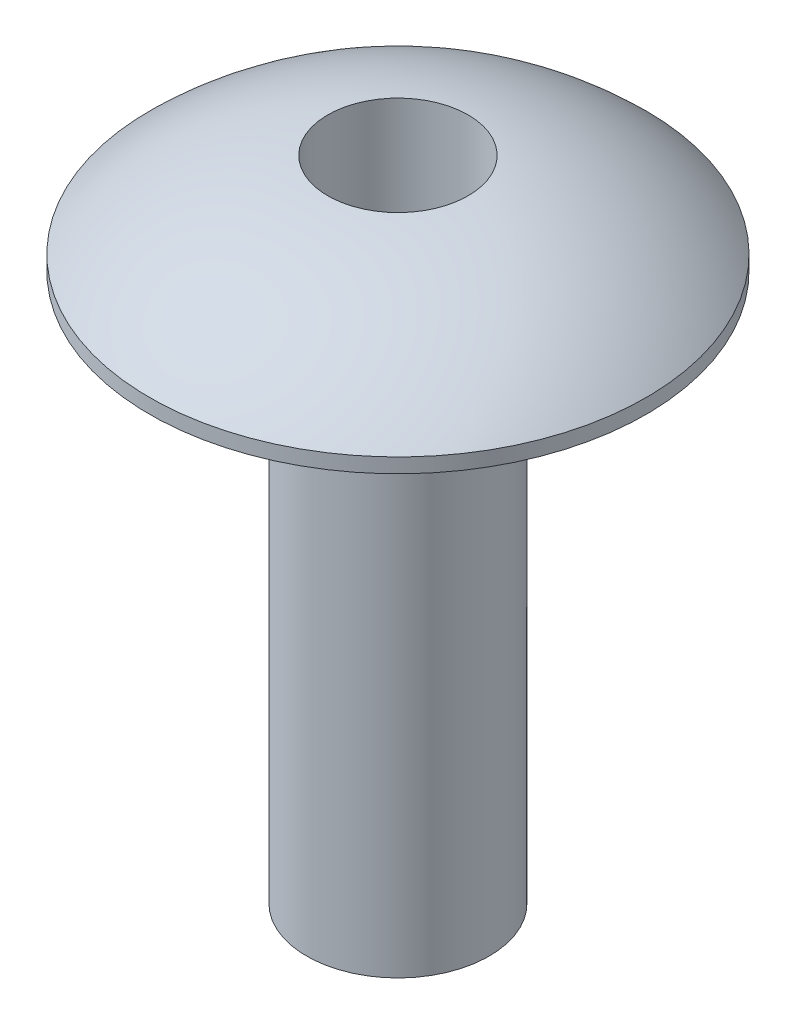
ISO-10303-21;
HEADER;
FILE_DESCRIPTION(('STEP AP214'),'2;1');
FILE_NAME('part.step','',(''),(''),'','','');
FILE_SCHEMA(('AUTOMOTIVE_DESIGN { 1 0 10303 214 1 1 1 1 }'));
ENDSEC;
DATA;
#1=APPLICATION_CONTEXT('core data for automotive mechanical design processes');
#2=APPLICATION_PROTOCOL_DEFINITION('international standard','automotive_design',2000,#1);
#3=PRODUCT_CONTEXT('',#1,'mechanical');
#4=PRODUCT('Part','Part','',(#3));
#5=PRODUCT_RELATED_PRODUCT_CATEGORY('part','',(#4));
#6=PRODUCT_DEFINITION_FORMATION('','',#4);
#7=PRODUCT_DEFINITION_CONTEXT('part definition',#1,'design');
#8=PRODUCT_DEFINITION('design','',#6,#7);
#9=PRODUCT_DEFINITION_SHAPE('','',#8);
#10=(LENGTH_UNIT() NAMED_UNIT(*) SI_UNIT(.MILLI.,.METRE.));
#11=(NAMED_UNIT(*) PLANE_ANGLE_UNIT() SI_UNIT($,.RADIAN.));
#12=(NAMED_UNIT(*) SI_UNIT($,.STERADIAN.) SOLID_ANGLE_UNIT());
#13=UNCERTAINTY_MEASURE_WITH_UNIT(LENGTH_MEASURE(1.E-05),#10,'distance_accuracy_value','');
#14=(GEOMETRIC_REPRESENTATION_CONTEXT(3) GLOBAL_UNCERTAINTY_ASSIGNED_CONTEXT((#13)) GLOBAL_UNIT_ASSIGNED_CONTEXT((#10,
#11,#12)) REPRESENTATION_CONTEXT('',''));
#15=CARTESIAN_POINT('',(0.,0.,0.));
#16=DIRECTION('',(0.,0.,1.));
#17=DIRECTION('',(1.,0.,0.));
#18=AXIS2_PLACEMENT_3D('',#15,#16,#17);
#19=CARTESIAN_POINT('',(0.,11.303,0.));
#20=DIRECTION('',(0.,-1.,0.));
#21=DIRECTION('',(0.,0.,-1.));
#22=AXIS2_PLACEMENT_3D('',#19,#20,#21);
#23=CYLINDRICAL_SURFACE('',#22,1.22019609195085);
#24=CARTESIAN_POINT('',(0.,11.2687527409834,0.));
#25=DIRECTION('',(0.,-1.,0.));
#26=DIRECTION('',(0.,0.,-1.));
#27=AXIS2_PLACEMENT_3D('',#24,#25,#26);
#28=CIRCLE('',#27,1.22019609195085);
#29=CARTESIAN_POINT('',(0.,11.2687527409834,-1.22019609195085));
#30=VERTEX_POINT('',#29);
#31=EDGE_CURVE('E29',#30,#30,#28,.T.);
#32=ORIENTED_EDGE('',*,*,#31,.F.);
#33=EDGE_LOOP('',(#32));
#34=FACE_BOUND('',#33,.T.);
#35=CARTESIAN_POINT('',(0.,0.,0.));
#36=DIRECTION('',(0.,-1.,0.));
#37=DIRECTION('',(0.,0.,-1.));
#38=AXIS2_PLACEMENT_3D('',#35,#36,#37);
#39=CIRCLE('',#38,1.22019609195085);
#40=CARTESIAN_POINT('',(0.,0.,-1.22019609195085));
#41=VERTEX_POINT('',#40);
#42=EDGE_CURVE('E17',#41,#41,#39,.T.);
#43=ORIENTED_EDGE('',*,*,#42,.T.);
#44=EDGE_LOOP('',(#43));
#45=FACE_BOUND('',#44,.T.);
#46=ADVANCED_FACE('F14',(#34,#45),#23,.F.);
#47=CARTESIAN_POINT('',(0.,0.,0.));
#48=DIRECTION('',(0.,1.,0.));
#49=DIRECTION('',(0.,0.,1.));
#50=AXIS2_PLACEMENT_3D('',#47,#48,#49);
#51=PLANE('',#50);
#52=CARTESIAN_POINT('',(0.,0.,0.));
#53=DIRECTION('',(0.,-1.,0.));
#54=DIRECTION('',(0.,0.,-1.));
#55=AXIS2_PLACEMENT_3D('',#52,#53,#54);
#56=CIRCLE('',#55,1.5875);
#57=CARTESIAN_POINT('',(0.,0.,-1.5875));
#58=VERTEX_POINT('',#57);
#59=EDGE_CURVE('E31',#58,#58,#56,.F.);
#60=ORIENTED_EDGE('',*,*,#59,.F.);
#61=EDGE_LOOP('',(#60));
#62=FACE_BOUND('',#61,.T.);
#63=ORIENTED_EDGE('',*,*,#42,.F.);
#64=EDGE_LOOP('',(#63));
#65=FACE_BOUND('',#64,.T.);
#66=ADVANCED_FACE('F44',(#62,#65),#51,.F.);
#67=CARTESIAN_POINT('',(0.,5.97237551201555,-0.580253599790508));
#68=DIRECTION('',(1.,0.,0.));
#69=DIRECTION('',(0.,0.,-1.));
#70=AXIS2_PLACEMENT_3D('',#67,#68,#69);
#71=CIRCLE('',#70,5.33489813818426);
#72=TRIMMED_CURVE('',#71,(PARAMETER_VALUE(-1.67977756346868)),
(PARAMETER_VALUE(1.67977756346868)),.T.,.PARAMETER.);
#73=CARTESIAN_POINT('',(0.,5.97237551201555,0.));
#74=DIRECTION('',(0.,-1.,0.));
#75=AXIS1_PLACEMENT('',#73,#74);
#76=SURFACE_OF_REVOLUTION('',#72,#75);
#77=CARTESIAN_POINT('',(0.,9.779,0.));
#78=DIRECTION('',(0.,-1.,0.));
#79=DIRECTION('',(0.,0.,-1.));
#80=AXIS2_PLACEMENT_3D('',#77,#78,#79);
#81=CIRCLE('',#80,4.318);
#82=CARTESIAN_POINT('',(0.,9.779,-4.318));
#83=VERTEX_POINT('',#82);
#84=EDGE_CURVE('E26',#83,#83,#81,.T.);
#85=ORIENTED_EDGE('',*,*,#84,.F.);
#86=EDGE_LOOP('',(#85));
#87=FACE_BOUND('',#86,.T.);
#88=ORIENTED_EDGE('',*,*,#31,.T.);
#89=EDGE_LOOP('',(#88));
#90=FACE_BOUND('',#89,.T.);
#91=ADVANCED_FACE('F46',(#87,#90),#76,.F.);
#92=CARTESIAN_POINT('',(0.,0.,0.));
#93=DIRECTION('',(0.,-1.,0.));
#94=DIRECTION('',(0.,0.,-1.));
#95=AXIS2_PLACEMENT_3D('',#92,#93,#94);
#96=CYLINDRICAL_SURFACE('',#95,1.5875);
#97=ORIENTED_EDGE('',*,*,#59,.T.);
#98=EDGE_LOOP('',(#97));
#99=FACE_BOUND('',#98,.T.);
#100=CARTESIAN_POINT('',(0.,9.525,0.));
#101=DIRECTION('',(0.,-1.,0.));
#102=DIRECTION('',(0.,0.,-1.));
#103=AXIS2_PLACEMENT_3D('',#100,#101,#102);
#104=CIRCLE('',#103,1.5875);
#105=CARTESIAN_POINT('',(0.,9.525,-1.5875));
#106=VERTEX_POINT('',#105);
#107=EDGE_CURVE('E21',#106,#106,#104,.T.);
#108=ORIENTED_EDGE('',*,*,#107,.T.);
#109=EDGE_LOOP('',(#108));
#110=FACE_BOUND('',#109,.T.);
#111=ADVANCED_FACE('F53',(#99,#110),#96,.T.);
#112=CARTESIAN_POINT('',(0.,0.,0.));
#113=DIRECTION('',(0.,-1.,0.));
#114=DIRECTION('',(0.,0.,-1.));
#115=AXIS2_PLACEMENT_3D('',#112,#113,#114);
#116=CYLINDRICAL_SURFACE('',#115,4.318);
#117=CARTESIAN_POINT('',(0.,9.525,0.));
#118=DIRECTION('',(0.,-1.,0.));
#119=DIRECTION('',(0.,0.,-1.));
#120=AXIS2_PLACEMENT_3D('',#117,#118,#119);
#121=CIRCLE('',#120,4.318);
#122=CARTESIAN_POINT('',(0.,9.525,-4.318));
#123=VERTEX_POINT('',#122);
#124=EDGE_CURVE('E10',#123,#123,#121,.F.);
#125=ORIENTED_EDGE('',*,*,#124,.T.);
#126=EDGE_LOOP('',(#125));
#127=FACE_BOUND('',#126,.T.);
#128=ORIENTED_EDGE('',*,*,#84,.T.);
#129=EDGE_LOOP('',(#128));
#130=FACE_BOUND('',#129,.T.);
#131=ADVANCED_FACE('F60',(#127,#130),#116,.T.);
#132=CARTESIAN_POINT('',(-1.5875,9.525,0.));
#133=DIRECTION('',(0.,1.,0.));
#134=DIRECTION('',(0.,0.,1.));
#135=AXIS2_PLACEMENT_3D('',#132,#133,#134);
#136=PLANE('',#135);
#137=ORIENTED_EDGE('',*,*,#124,.F.);
#138=EDGE_LOOP('',(#137));
#139=FACE_BOUND('',#138,.T.);
#140=ORIENTED_EDGE('',*,*,#107,.F.);
#141=EDGE_LOOP('',(#140));
#142=FACE_BOUND('',#141,.T.);
#143=ADVANCED_FACE('F58',(#139,#142),#136,.F.);
#144=CLOSED_SHELL('',(#46,#66,#91,#111,#131,#143));
#145=MANIFOLD_SOLID_BREP('B1',#144);
#146=ADVANCED_BREP_SHAPE_REPRESENTATION('',(#18,#145),#14);
#147=SHAPE_DEFINITION_REPRESENTATION(#9,#146);
ENDSEC;
END-ISO-10303-21;
